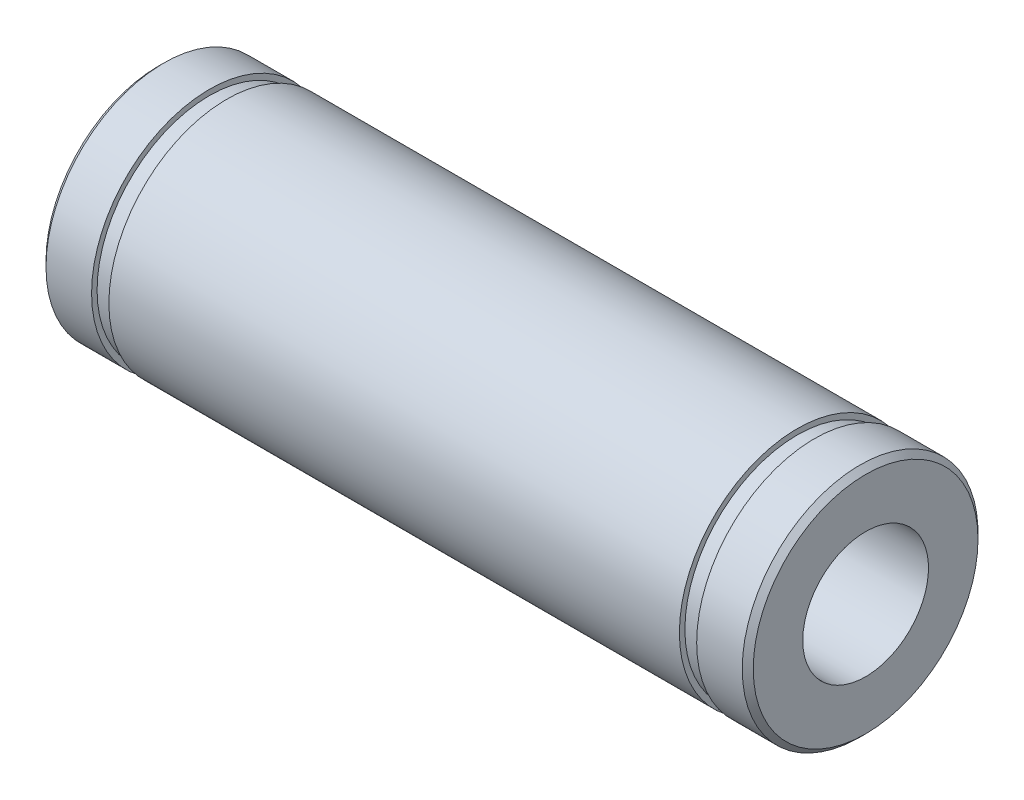
ISO-10303-21;
HEADER;
FILE_DESCRIPTION(('STEP AP214'),'2;1');
FILE_NAME('part.step','',(''),(''),'','','');
FILE_SCHEMA(('AUTOMOTIVE_DESIGN { 1 0 10303 214 1 1 1 1 }'));
ENDSEC;
DATA;
#1=APPLICATION_CONTEXT('core data for automotive mechanical design processes');
#2=APPLICATION_PROTOCOL_DEFINITION('international standard','automotive_design',2000,#1);
#3=PRODUCT_CONTEXT('',#1,'mechanical');
#4=PRODUCT('Part','Part','',(#3));
#5=PRODUCT_RELATED_PRODUCT_CATEGORY('part','',(#4));
#6=PRODUCT_DEFINITION_FORMATION('','',#4);
#7=PRODUCT_DEFINITION_CONTEXT('part definition',#1,'design');
#8=PRODUCT_DEFINITION('design','',#6,#7);
#9=PRODUCT_DEFINITION_SHAPE('','',#8);
#10=(LENGTH_UNIT() NAMED_UNIT(*) SI_UNIT(.MILLI.,.METRE.));
#11=(NAMED_UNIT(*) PLANE_ANGLE_UNIT() SI_UNIT($,.RADIAN.));
#12=(NAMED_UNIT(*) SI_UNIT($,.STERADIAN.) SOLID_ANGLE_UNIT());
#13=UNCERTAINTY_MEASURE_WITH_UNIT(LENGTH_MEASURE(1.E-05),#10,'distance_accuracy_value','');
#14=(GEOMETRIC_REPRESENTATION_CONTEXT(3) GLOBAL_UNCERTAINTY_ASSIGNED_CONTEXT((#13)) GLOBAL_UNIT_ASSIGNED_CONTEXT((#10,
#11,#12)) REPRESENTATION_CONTEXT('',''));
#15=CARTESIAN_POINT('',(0.,0.,0.));
#16=DIRECTION('',(0.,0.,1.));
#17=DIRECTION('',(1.,0.,0.));
#18=AXIS2_PLACEMENT_3D('',#15,#16,#17);
#19=CARTESIAN_POINT('',(32.65,0.,0.));
#20=DIRECTION('',(-1.,0.,0.));
#21=DIRECTION('',(0.,0.,1.));
#22=AXIS2_PLACEMENT_3D('',#19,#20,#21);
#23=CONICAL_SURFACE('',#22,7.49999999999999,0.785398163397446);
#24=CARTESIAN_POINT('',(32.9999999999999,0.,0.));
#25=DIRECTION('',(-1.,0.,0.));
#26=DIRECTION('',(0.,0.,1.));
#27=AXIS2_PLACEMENT_3D('',#24,#25,#26);
#28=CIRCLE('',#27,7.15000000000002);
#29=CARTESIAN_POINT('',(32.9999999999999,0.,7.15000000000002));
#30=VERTEX_POINT('',#29);
#31=EDGE_CURVE('E10',#30,#30,#28,.T.);
#32=ORIENTED_EDGE('',*,*,#31,.T.);
#33=EDGE_LOOP('',(#32));
#34=FACE_BOUND('',#33,.T.);
#35=CARTESIAN_POINT('',(32.65,0.,0.));
#36=DIRECTION('',(-1.,0.,0.));
#37=DIRECTION('',(0.,0.,1.));
#38=AXIS2_PLACEMENT_3D('',#35,#36,#37);
#39=CIRCLE('',#38,7.49999999999999);
#40=CARTESIAN_POINT('',(32.65,0.,7.49999999999999));
#41=VERTEX_POINT('',#40);
#42=EDGE_CURVE('E102',#41,#41,#39,.T.);
#43=ORIENTED_EDGE('',*,*,#42,.F.);
#44=EDGE_LOOP('',(#43));
#45=FACE_BOUND('',#44,.T.);
#46=ADVANCED_FACE('F43',(#34,#45),#23,.T.);
#47=CARTESIAN_POINT('',(32.9999999999999,0.,7.15000000000002));
#48=DIRECTION('',(1.,0.,0.));
#49=DIRECTION('',(0.,0.,-1.));
#50=AXIS2_PLACEMENT_3D('',#47,#48,#49);
#51=PLANE('',#50);
#52=CARTESIAN_POINT('',(32.9999999999999,0.,0.));
#53=DIRECTION('',(-1.,0.,0.));
#54=DIRECTION('',(0.,0.,1.));
#55=AXIS2_PLACEMENT_3D('',#52,#53,#54);
#56=CIRCLE('',#55,4.00000000000002);
#57=CARTESIAN_POINT('',(32.9999999999999,0.,4.00000000000002));
#58=VERTEX_POINT('',#57);
#59=EDGE_CURVE('E50',#58,#58,#56,.T.);
#60=ORIENTED_EDGE('',*,*,#59,.T.);
#61=EDGE_LOOP('',(#60));
#62=FACE_BOUND('',#61,.T.);
#63=ORIENTED_EDGE('',*,*,#31,.F.);
#64=EDGE_LOOP('',(#63));
#65=FACE_BOUND('',#64,.T.);
#66=ADVANCED_FACE('F111',(#62,#65),#51,.T.);
#67=CARTESIAN_POINT('',(-14.5480382670718,0.,0.));
#68=DIRECTION('',(-1.,0.,0.));
#69=DIRECTION('',(0.,0.,1.));
#70=AXIS2_PLACEMENT_3D('',#67,#68,#69);
#71=CYLINDRICAL_SURFACE('',#70,4.00000000000001);
#72=CARTESIAN_POINT('',(-12.,0.,0.));
#73=DIRECTION('',(-1.,0.,0.));
#74=DIRECTION('',(0.,0.,1.));
#75=AXIS2_PLACEMENT_3D('',#72,#73,#74);
#76=CIRCLE('',#75,4.);
#77=CARTESIAN_POINT('',(-12.,0.,4.));
#78=VERTEX_POINT('',#77);
#79=EDGE_CURVE('E55',#78,#78,#76,.T.);
#80=ORIENTED_EDGE('',*,*,#79,.T.);
#81=EDGE_LOOP('',(#80));
#82=FACE_BOUND('',#81,.T.);
#83=ORIENTED_EDGE('',*,*,#59,.F.);
#84=EDGE_LOOP('',(#83));
#85=FACE_BOUND('',#84,.T.);
#86=ADVANCED_FACE('F115',(#82,#85),#71,.F.);
#87=CARTESIAN_POINT('',(-12.,0.,7.14999999999999));
#88=DIRECTION('',(-1.,0.,0.));
#89=DIRECTION('',(0.,0.,1.));
#90=AXIS2_PLACEMENT_3D('',#87,#88,#89);
#91=PLANE('',#90);
#92=CARTESIAN_POINT('',(-12.,0.,0.));
#93=DIRECTION('',(-1.,0.,0.));
#94=DIRECTION('',(0.,0.,1.));
#95=AXIS2_PLACEMENT_3D('',#92,#93,#94);
#96=CIRCLE('',#95,7.14999999999999);
#97=CARTESIAN_POINT('',(-12.,0.,7.14999999999999));
#98=VERTEX_POINT('',#97);
#99=EDGE_CURVE('E60',#98,#98,#96,.T.);
#100=ORIENTED_EDGE('',*,*,#99,.T.);
#101=EDGE_LOOP('',(#100));
#102=FACE_BOUND('',#101,.T.);
#103=ORIENTED_EDGE('',*,*,#79,.F.);
#104=EDGE_LOOP('',(#103));
#105=FACE_BOUND('',#104,.T.);
#106=ADVANCED_FACE('F119',(#102,#105),#91,.T.);
#107=CARTESIAN_POINT('',(-12.,0.,0.));
#108=DIRECTION('',(1.,0.,0.));
#109=DIRECTION('',(0.,0.,-1.));
#110=AXIS2_PLACEMENT_3D('',#107,#108,#109);
#111=CONICAL_SURFACE('',#110,7.14999999999999,0.785398163397437);
#112=CARTESIAN_POINT('',(-11.65,0.,0.));
#113=DIRECTION('',(-1.,0.,0.));
#114=DIRECTION('',(0.,0.,1.));
#115=AXIS2_PLACEMENT_3D('',#112,#113,#114);
#116=CIRCLE('',#115,7.5);
#117=CARTESIAN_POINT('',(-11.65,0.,7.5));
#118=VERTEX_POINT('',#117);
#119=EDGE_CURVE('E66',#118,#118,#116,.T.);
#120=ORIENTED_EDGE('',*,*,#119,.T.);
#121=EDGE_LOOP('',(#120));
#122=FACE_BOUND('',#121,.T.);
#123=ORIENTED_EDGE('',*,*,#99,.F.);
#124=EDGE_LOOP('',(#123));
#125=FACE_BOUND('',#124,.T.);
#126=ADVANCED_FACE('F126',(#122,#125),#111,.T.);
#127=CARTESIAN_POINT('',(-14.5480382670718,0.,0.));
#128=DIRECTION('',(-1.,0.,0.));
#129=DIRECTION('',(0.,0.,1.));
#130=AXIS2_PLACEMENT_3D('',#127,#128,#129);
#131=CYLINDRICAL_SURFACE('',#130,7.5);
#132=CARTESIAN_POINT('',(-8.75,0.,0.));
#133=DIRECTION('',(-1.,0.,0.));
#134=DIRECTION('',(0.,0.,1.));
#135=AXIS2_PLACEMENT_3D('',#132,#133,#134);
#136=CIRCLE('',#135,7.5);
#137=CARTESIAN_POINT('',(-8.75,0.,7.5));
#138=VERTEX_POINT('',#137);
#139=EDGE_CURVE('E70',#138,#138,#136,.T.);
#140=ORIENTED_EDGE('',*,*,#139,.T.);
#141=EDGE_LOOP('',(#140));
#142=FACE_BOUND('',#141,.T.);
#143=ORIENTED_EDGE('',*,*,#119,.F.);
#144=EDGE_LOOP('',(#143));
#145=FACE_BOUND('',#144,.T.);
#146=ADVANCED_FACE('F130',(#142,#145),#131,.T.);
#147=CARTESIAN_POINT('',(-8.75,0.,7.14999999999999));
#148=DIRECTION('',(1.,0.,0.));
#149=DIRECTION('',(0.,0.,-1.));
#150=AXIS2_PLACEMENT_3D('',#147,#148,#149);
#151=PLANE('',#150);
#152=CARTESIAN_POINT('',(-8.75,0.,0.));
#153=DIRECTION('',(-1.,0.,0.));
#154=DIRECTION('',(0.,0.,1.));
#155=AXIS2_PLACEMENT_3D('',#152,#153,#154);
#156=CIRCLE('',#155,7.14999999999999);
#157=CARTESIAN_POINT('',(-8.75,0.,7.14999999999999));
#158=VERTEX_POINT('',#157);
#159=EDGE_CURVE('E74',#158,#158,#156,.T.);
#160=ORIENTED_EDGE('',*,*,#159,.T.);
#161=EDGE_LOOP('',(#160));
#162=FACE_BOUND('',#161,.T.);
#163=ORIENTED_EDGE('',*,*,#139,.F.);
#164=EDGE_LOOP('',(#163));
#165=FACE_BOUND('',#164,.T.);
#166=ADVANCED_FACE('F134',(#162,#165),#151,.T.);
#167=CARTESIAN_POINT('',(-14.5480382670718,0.,0.));
#168=DIRECTION('',(-1.,0.,0.));
#169=DIRECTION('',(0.,0.,1.));
#170=AXIS2_PLACEMENT_3D('',#167,#168,#169);
#171=CYLINDRICAL_SURFACE('',#170,7.14999999999999);
#172=CARTESIAN_POINT('',(-7.64999999999996,0.,0.));
#173=DIRECTION('',(-1.,0.,0.));
#174=DIRECTION('',(0.,0.,1.));
#175=AXIS2_PLACEMENT_3D('',#172,#173,#174);
#176=CIRCLE('',#175,7.14999999999999);
#177=CARTESIAN_POINT('',(-7.64999999999996,0.,7.14999999999999));
#178=VERTEX_POINT('',#177);
#179=EDGE_CURVE('E78',#178,#178,#176,.T.);
#180=ORIENTED_EDGE('',*,*,#179,.T.);
#181=EDGE_LOOP('',(#180));
#182=FACE_BOUND('',#181,.T.);
#183=ORIENTED_EDGE('',*,*,#159,.F.);
#184=EDGE_LOOP('',(#183));
#185=FACE_BOUND('',#184,.T.);
#186=ADVANCED_FACE('F138',(#182,#185),#171,.T.);
#187=CARTESIAN_POINT('',(-7.64999999999998,0.,7.14999999999999));
#188=DIRECTION('',(-1.,0.,0.));
#189=DIRECTION('',(0.,0.,1.));
#190=AXIS2_PLACEMENT_3D('',#187,#188,#189);
#191=PLANE('',#190);
#192=CARTESIAN_POINT('',(-7.65,0.,0.));
#193=DIRECTION('',(-1.,0.,0.));
#194=DIRECTION('',(0.,0.,1.));
#195=AXIS2_PLACEMENT_3D('',#192,#193,#194);
#196=CIRCLE('',#195,7.5);
#197=CARTESIAN_POINT('',(-7.65,0.,7.5));
#198=VERTEX_POINT('',#197);
#199=EDGE_CURVE('E82',#198,#198,#196,.T.);
#200=ORIENTED_EDGE('',*,*,#199,.T.);
#201=EDGE_LOOP('',(#200));
#202=FACE_BOUND('',#201,.T.);
#203=ORIENTED_EDGE('',*,*,#179,.F.);
#204=EDGE_LOOP('',(#203));
#205=FACE_BOUND('',#204,.T.);
#206=ADVANCED_FACE('F142',(#202,#205),#191,.T.);
#207=CARTESIAN_POINT('',(-14.5480382670718,0.,0.));
#208=DIRECTION('',(-1.,0.,0.));
#209=DIRECTION('',(0.,0.,1.));
#210=AXIS2_PLACEMENT_3D('',#207,#208,#209);
#211=CYLINDRICAL_SURFACE('',#210,7.5);
#212=CARTESIAN_POINT('',(28.65,0.,0.));
#213=DIRECTION('',(-1.,0.,0.));
#214=DIRECTION('',(0.,0.,1.));
#215=AXIS2_PLACEMENT_3D('',#212,#213,#214);
#216=CIRCLE('',#215,7.5);
#217=CARTESIAN_POINT('',(28.65,0.,7.5));
#218=VERTEX_POINT('',#217);
#219=EDGE_CURVE('E86',#218,#218,#216,.T.);
#220=ORIENTED_EDGE('',*,*,#219,.T.);
#221=EDGE_LOOP('',(#220));
#222=FACE_BOUND('',#221,.T.);
#223=ORIENTED_EDGE('',*,*,#199,.F.);
#224=EDGE_LOOP('',(#223));
#225=FACE_BOUND('',#224,.T.);
#226=ADVANCED_FACE('F146',(#222,#225),#211,.T.);
#227=CARTESIAN_POINT('',(28.65,0.,7.15));
#228=DIRECTION('',(1.,0.,0.));
#229=DIRECTION('',(0.,0.,-1.));
#230=AXIS2_PLACEMENT_3D('',#227,#228,#229);
#231=PLANE('',#230);
#232=CARTESIAN_POINT('',(28.65,0.,0.));
#233=DIRECTION('',(-1.,0.,0.));
#234=DIRECTION('',(0.,0.,1.));
#235=AXIS2_PLACEMENT_3D('',#232,#233,#234);
#236=CIRCLE('',#235,7.15);
#237=CARTESIAN_POINT('',(28.65,0.,7.15));
#238=VERTEX_POINT('',#237);
#239=EDGE_CURVE('E90',#238,#238,#236,.T.);
#240=ORIENTED_EDGE('',*,*,#239,.T.);
#241=EDGE_LOOP('',(#240));
#242=FACE_BOUND('',#241,.T.);
#243=ORIENTED_EDGE('',*,*,#219,.F.);
#244=EDGE_LOOP('',(#243));
#245=FACE_BOUND('',#244,.T.);
#246=ADVANCED_FACE('F150',(#242,#245),#231,.T.);
#247=CARTESIAN_POINT('',(-14.5480382670718,0.,0.));
#248=DIRECTION('',(-1.,0.,0.));
#249=DIRECTION('',(0.,0.,1.));
#250=AXIS2_PLACEMENT_3D('',#247,#248,#249);
#251=CYLINDRICAL_SURFACE('',#250,7.15);
#252=CARTESIAN_POINT('',(29.75,0.,0.));
#253=DIRECTION('',(-1.,0.,0.));
#254=DIRECTION('',(0.,0.,1.));
#255=AXIS2_PLACEMENT_3D('',#252,#253,#254);
#256=CIRCLE('',#255,7.15);
#257=CARTESIAN_POINT('',(29.75,0.,7.15));
#258=VERTEX_POINT('',#257);
#259=EDGE_CURVE('E94',#258,#258,#256,.T.);
#260=ORIENTED_EDGE('',*,*,#259,.T.);
#261=EDGE_LOOP('',(#260));
#262=FACE_BOUND('',#261,.T.);
#263=ORIENTED_EDGE('',*,*,#239,.F.);
#264=EDGE_LOOP('',(#263));
#265=FACE_BOUND('',#264,.T.);
#266=ADVANCED_FACE('F154',(#262,#265),#251,.T.);
#267=CARTESIAN_POINT('',(29.75,0.,7.49999999999999));
#268=DIRECTION('',(-1.,0.,0.));
#269=DIRECTION('',(0.,0.,1.));
#270=AXIS2_PLACEMENT_3D('',#267,#268,#269);
#271=PLANE('',#270);
#272=CARTESIAN_POINT('',(29.75,0.,0.));
#273=DIRECTION('',(-1.,0.,0.));
#274=DIRECTION('',(0.,0.,1.));
#275=AXIS2_PLACEMENT_3D('',#272,#273,#274);
#276=CIRCLE('',#275,7.49999999999999);
#277=CARTESIAN_POINT('',(29.75,0.,7.49999999999999));
#278=VERTEX_POINT('',#277);
#279=EDGE_CURVE('E98',#278,#278,#276,.T.);
#280=ORIENTED_EDGE('',*,*,#279,.T.);
#281=EDGE_LOOP('',(#280));
#282=FACE_BOUND('',#281,.T.);
#283=ORIENTED_EDGE('',*,*,#259,.F.);
#284=EDGE_LOOP('',(#283));
#285=FACE_BOUND('',#284,.T.);
#286=ADVANCED_FACE('F158',(#282,#285),#271,.T.);
#287=CARTESIAN_POINT('',(-14.5480382670718,0.,0.));
#288=DIRECTION('',(-1.,0.,0.));
#289=DIRECTION('',(0.,0.,1.));
#290=AXIS2_PLACEMENT_3D('',#287,#288,#289);
#291=CYLINDRICAL_SURFACE('',#290,7.49999999999999);
#292=ORIENTED_EDGE('',*,*,#42,.T.);
#293=EDGE_LOOP('',(#292));
#294=FACE_BOUND('',#293,.T.);
#295=ORIENTED_EDGE('',*,*,#279,.F.);
#296=EDGE_LOOP('',(#295));
#297=FACE_BOUND('',#296,.T.);
#298=ADVANCED_FACE('F107',(#294,#297),#291,.T.);
#299=CLOSED_SHELL('',(#46,#66,#86,#106,#126,#146,#166,#186,#206,#226,#246,#266,#286,#298));
#300=MANIFOLD_SOLID_BREP('B2',#299);
#301=ADVANCED_BREP_SHAPE_REPRESENTATION('',(#18,#300),#14);
#302=SHAPE_DEFINITION_REPRESENTATION(#9,#301);
ENDSEC;
END-ISO-10303-21;
